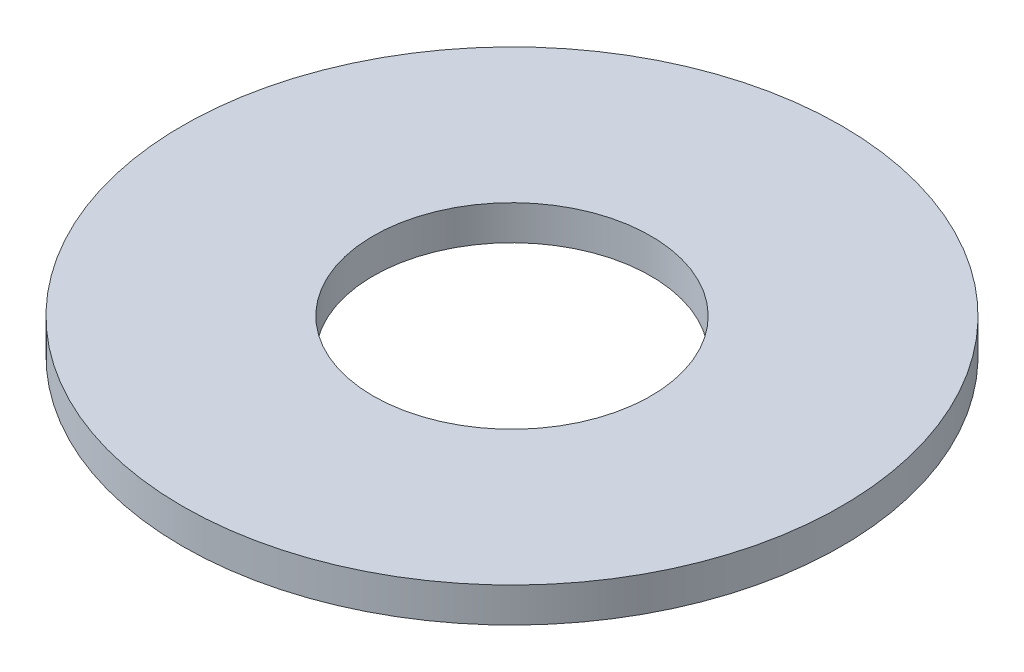
ISO-10303-21;
HEADER;
FILE_DESCRIPTION(('STEP AP214'),'2;1');
FILE_NAME('part.step','',(''),(''),'','','');
FILE_SCHEMA(('AUTOMOTIVE_DESIGN { 1 0 10303 214 1 1 1 1 }'));
ENDSEC;
DATA;
#1=APPLICATION_CONTEXT('core data for automotive mechanical design processes');
#2=APPLICATION_PROTOCOL_DEFINITION('international standard','automotive_design',2000,#1);
#3=PRODUCT_CONTEXT('',#1,'mechanical');
#4=PRODUCT('Part','Part','',(#3));
#5=PRODUCT_RELATED_PRODUCT_CATEGORY('part','',(#4));
#6=PRODUCT_DEFINITION_FORMATION('','',#4);
#7=PRODUCT_DEFINITION_CONTEXT('part definition',#1,'design');
#8=PRODUCT_DEFINITION('design','',#6,#7);
#9=PRODUCT_DEFINITION_SHAPE('','',#8);
#10=(LENGTH_UNIT() NAMED_UNIT(*) SI_UNIT(.MILLI.,.METRE.));
#11=(NAMED_UNIT(*) PLANE_ANGLE_UNIT() SI_UNIT($,.RADIAN.));
#12=(NAMED_UNIT(*) SI_UNIT($,.STERADIAN.) SOLID_ANGLE_UNIT());
#13=UNCERTAINTY_MEASURE_WITH_UNIT(LENGTH_MEASURE(1.E-05),#10,'distance_accuracy_value','');
#14=(GEOMETRIC_REPRESENTATION_CONTEXT(3) GLOBAL_UNCERTAINTY_ASSIGNED_CONTEXT((#13)) GLOBAL_UNIT_ASSIGNED_CONTEXT((#10,
#11,#12)) REPRESENTATION_CONTEXT('',''));
#15=CARTESIAN_POINT('',(0.,0.,0.));
#16=DIRECTION('',(0.,0.,1.));
#17=DIRECTION('',(1.,0.,0.));
#18=AXIS2_PLACEMENT_3D('',#15,#16,#17);
#19=CARTESIAN_POINT('',(0.,5.,0.));
#20=DIRECTION('',(0.,-1.,0.));
#21=DIRECTION('',(0.,0.,-1.));
#22=AXIS2_PLACEMENT_3D('',#19,#20,#21);
#23=CYLINDRICAL_SURFACE('',#22,47.5);
#24=CARTESIAN_POINT('',(0.,5.,0.));
#25=DIRECTION('',(0.,1.,0.));
#26=DIRECTION('',(0.,0.,1.));
#27=AXIS2_PLACEMENT_3D('',#24,#25,#26);
#28=CIRCLE('',#27,47.5);
#29=CARTESIAN_POINT('',(0.,5.,47.5));
#30=VERTEX_POINT('',#29);
#31=EDGE_CURVE('E10',#30,#30,#28,.T.);
#32=ORIENTED_EDGE('',*,*,#31,.F.);
#33=EDGE_LOOP('',(#32));
#34=FACE_BOUND('',#33,.T.);
#35=CARTESIAN_POINT('',(0.,0.,0.));
#36=DIRECTION('',(0.,1.,0.));
#37=DIRECTION('',(0.,0.,1.));
#38=AXIS2_PLACEMENT_3D('',#35,#36,#37);
#39=CIRCLE('',#38,47.5);
#40=CARTESIAN_POINT('',(0.,0.,47.5));
#41=VERTEX_POINT('',#40);
#42=EDGE_CURVE('E37',#41,#41,#39,.T.);
#43=ORIENTED_EDGE('',*,*,#42,.T.);
#44=EDGE_LOOP('',(#43));
#45=FACE_BOUND('',#44,.T.);
#46=ADVANCED_FACE('F40',(#34,#45),#23,.T.);
#47=CARTESIAN_POINT('',(0.,5.,0.));
#48=DIRECTION('',(0.,1.,0.));
#49=DIRECTION('',(0.,0.,1.));
#50=AXIS2_PLACEMENT_3D('',#47,#48,#49);
#51=PLANE('',#50);
#52=CARTESIAN_POINT('',(0.,5.,0.));
#53=DIRECTION('',(0.,1.,0.));
#54=DIRECTION('',(0.,0.,1.));
#55=AXIS2_PLACEMENT_3D('',#52,#53,#54);
#56=CIRCLE('',#55,20.);
#57=CARTESIAN_POINT('',(0.,5.,20.));
#58=VERTEX_POINT('',#57);
#59=EDGE_CURVE('E50',#58,#58,#56,.T.);
#60=ORIENTED_EDGE('',*,*,#59,.F.);
#61=EDGE_LOOP('',(#60));
#62=FACE_BOUND('',#61,.T.);
#63=ORIENTED_EDGE('',*,*,#31,.T.);
#64=EDGE_LOOP('',(#63));
#65=FACE_BOUND('',#64,.T.);
#66=ADVANCED_FACE('F59',(#62,#65),#51,.T.);
#67=CARTESIAN_POINT('',(0.,0.,0.));
#68=DIRECTION('',(0.,1.,0.));
#69=DIRECTION('',(0.,0.,1.));
#70=AXIS2_PLACEMENT_3D('',#67,#68,#69);
#71=PLANE('',#70);
#72=CARTESIAN_POINT('',(0.,0.,0.));
#73=DIRECTION('',(0.,1.,0.));
#74=DIRECTION('',(0.,0.,1.));
#75=AXIS2_PLACEMENT_3D('',#72,#73,#74);
#76=CIRCLE('',#75,20.);
#77=CARTESIAN_POINT('',(0.,0.,20.));
#78=VERTEX_POINT('',#77);
#79=EDGE_CURVE('E47',#78,#78,#76,.T.);
#80=ORIENTED_EDGE('',*,*,#79,.T.);
#81=EDGE_LOOP('',(#80));
#82=FACE_BOUND('',#81,.T.);
#83=ORIENTED_EDGE('',*,*,#42,.F.);
#84=EDGE_LOOP('',(#83));
#85=FACE_BOUND('',#84,.T.);
#86=ADVANCED_FACE('F58',(#82,#85),#71,.F.);
#87=CARTESIAN_POINT('',(0.,5.,0.));
#88=DIRECTION('',(0.,-1.,0.));
#89=DIRECTION('',(0.,0.,-1.));
#90=AXIS2_PLACEMENT_3D('',#87,#88,#89);
#91=CYLINDRICAL_SURFACE('',#90,20.);
#92=ORIENTED_EDGE('',*,*,#59,.T.);
#93=EDGE_LOOP('',(#92));
#94=FACE_BOUND('',#93,.T.);
#95=ORIENTED_EDGE('',*,*,#79,.F.);
#96=EDGE_LOOP('',(#95));
#97=FACE_BOUND('',#96,.T.);
#98=ADVANCED_FACE('F54',(#94,#97),#91,.F.);
#99=CLOSED_SHELL('',(#46,#66,#86,#98));
#100=MANIFOLD_SOLID_BREP('B2',#99);
#101=ADVANCED_BREP_SHAPE_REPRESENTATION('',(#18,#100),#14);
#102=SHAPE_DEFINITION_REPRESENTATION(#9,#101);
ENDSEC;
END-ISO-10303-21;
